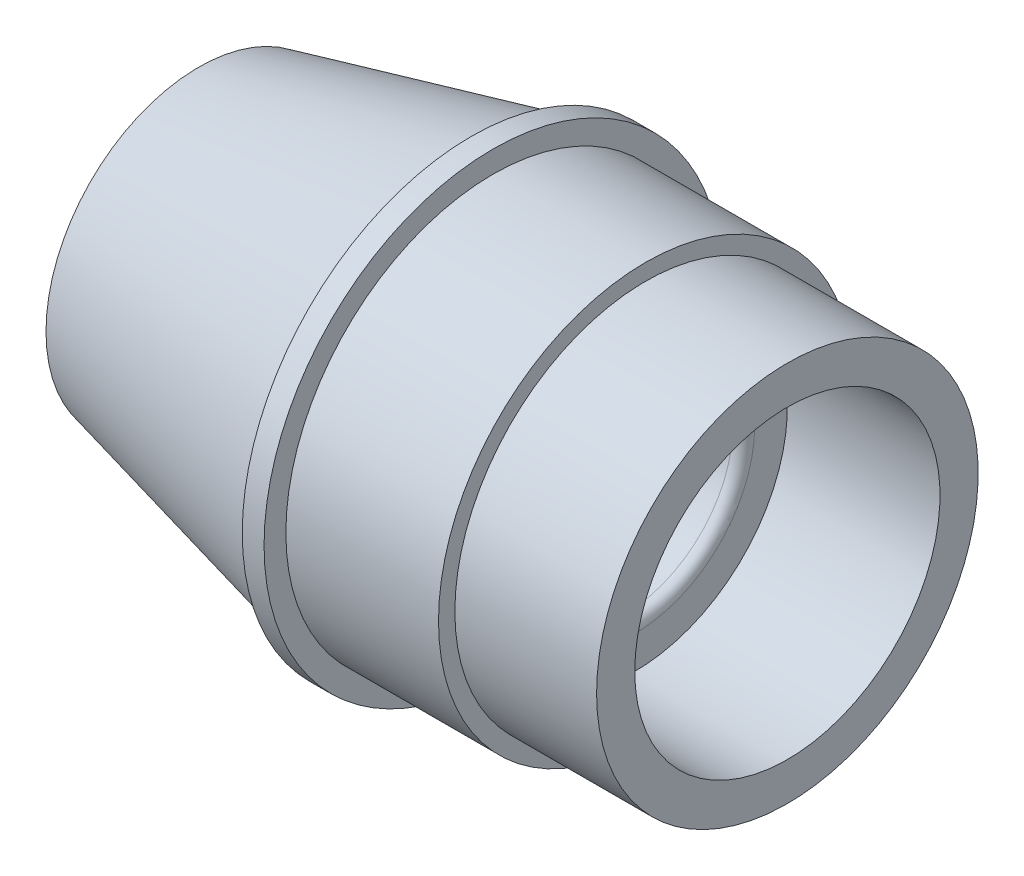
ISO-10303-21;
HEADER;
FILE_DESCRIPTION(('STEP AP214'),'2;1');
FILE_NAME('part.step','',(''),(''),'','','');
FILE_SCHEMA(('AUTOMOTIVE_DESIGN { 1 0 10303 214 1 1 1 1 }'));
ENDSEC;
DATA;
#1=APPLICATION_CONTEXT('core data for automotive mechanical design processes');
#2=APPLICATION_PROTOCOL_DEFINITION('international standard','automotive_design',2000,#1);
#3=PRODUCT_CONTEXT('',#1,'mechanical');
#4=PRODUCT('Part','Part','',(#3));
#5=PRODUCT_RELATED_PRODUCT_CATEGORY('part','',(#4));
#6=PRODUCT_DEFINITION_FORMATION('','',#4);
#7=PRODUCT_DEFINITION_CONTEXT('part definition',#1,'design');
#8=PRODUCT_DEFINITION('design','',#6,#7);
#9=PRODUCT_DEFINITION_SHAPE('','',#8);
#10=(LENGTH_UNIT() NAMED_UNIT(*) SI_UNIT(.MILLI.,.METRE.));
#11=(NAMED_UNIT(*) PLANE_ANGLE_UNIT() SI_UNIT($,.RADIAN.));
#12=(NAMED_UNIT(*) SI_UNIT($,.STERADIAN.) SOLID_ANGLE_UNIT());
#13=UNCERTAINTY_MEASURE_WITH_UNIT(LENGTH_MEASURE(1.E-05),#10,'distance_accuracy_value','');
#14=(GEOMETRIC_REPRESENTATION_CONTEXT(3) GLOBAL_UNCERTAINTY_ASSIGNED_CONTEXT((#13)) GLOBAL_UNIT_ASSIGNED_CONTEXT((#10,
#11,#12)) REPRESENTATION_CONTEXT('',''));
#15=CARTESIAN_POINT('',(0.,0.,0.));
#16=DIRECTION('',(0.,0.,1.));
#17=DIRECTION('',(1.,0.,0.));
#18=AXIS2_PLACEMENT_3D('',#15,#16,#17);
#19=CARTESIAN_POINT('',(-27.,10.,0.));
#20=DIRECTION('',(1.,0.,0.));
#21=DIRECTION('',(0.,0.,-1.));
#22=AXIS2_PLACEMENT_3D('',#19,#20,#21);
#23=PLANE('',#22);
#24=CARTESIAN_POINT('',(-27.,0.,0.));
#25=DIRECTION('',(-1.,0.,0.));
#26=DIRECTION('',(0.,0.,1.));
#27=AXIS2_PLACEMENT_3D('',#24,#25,#26);
#28=CIRCLE('',#27,10.);
#29=CARTESIAN_POINT('',(-27.,0.,10.));
#30=VERTEX_POINT('',#29);
#31=EDGE_CURVE('E76',#30,#30,#28,.T.);
#32=ORIENTED_EDGE('',*,*,#31,.F.);
#33=EDGE_LOOP('',(#32));
#34=FACE_BOUND('',#33,.T.);
#35=CARTESIAN_POINT('',(-27.,0.,0.));
#36=DIRECTION('',(-1.,0.,0.));
#37=DIRECTION('',(0.,0.,1.));
#38=AXIS2_PLACEMENT_3D('',#35,#36,#37);
#39=CIRCLE('',#38,14.);
#40=CARTESIAN_POINT('',(-27.,0.,14.));
#41=VERTEX_POINT('',#40);
#42=EDGE_CURVE('E10',#41,#41,#39,.T.);
#43=ORIENTED_EDGE('',*,*,#42,.T.);
#44=EDGE_LOOP('',(#43));
#45=FACE_BOUND('',#44,.T.);
#46=ADVANCED_FACE('F30',(#34,#45),#23,.F.);
#47=CARTESIAN_POINT('',(-2.22281554755738,0.,0.));
#48=DIRECTION('',(1.,0.,0.));
#49=DIRECTION('',(0.,0.,-1.));
#50=AXIS2_PLACEMENT_3D('',#47,#48,#49);
#51=CONICAL_SURFACE('',#50,19.9465242685862,0.235544980720863);
#52=ORIENTED_EDGE('',*,*,#42,.F.);
#53=EDGE_LOOP('',(#52));
#54=FACE_BOUND('',#53,.T.);
#55=CARTESIAN_POINT('',(-2.22281554755738,0.,0.));
#56=DIRECTION('',(-1.,0.,0.));
#57=DIRECTION('',(0.,0.,1.));
#58=AXIS2_PLACEMENT_3D('',#55,#56,#57);
#59=CIRCLE('',#58,19.9465242685862);
#60=CARTESIAN_POINT('',(-2.22281554755738,0.,19.9465242685862));
#61=VERTEX_POINT('',#60);
#62=EDGE_CURVE('E36',#61,#61,#59,.T.);
#63=ORIENTED_EDGE('',*,*,#62,.T.);
#64=EDGE_LOOP('',(#63));
#65=FACE_BOUND('',#64,.T.);
#66=ADVANCED_FACE('F83',(#54,#65),#51,.T.);
#67=CARTESIAN_POINT('',(-2.29064399472575,0.,0.));
#68=DIRECTION('',(-1.,0.,0.));
#69=DIRECTION('',(0.,0.,1.));
#70=AXIS2_PLACEMENT_3D('',#67,#68,#69);
#71=TOROIDAL_SURFACE('',#70,20.2291427984544,0.290643994725751);
#72=ORIENTED_EDGE('',*,*,#62,.F.);
#73=EDGE_LOOP('',(#72));
#74=FACE_BOUND('',#73,.T.);
#75=CARTESIAN_POINT('',(-2.,0.,0.));
#76=DIRECTION('',(-1.,0.,0.));
#77=DIRECTION('',(0.,0.,1.));
#78=AXIS2_PLACEMENT_3D('',#75,#76,#77);
#79=CIRCLE('',#78,20.2291427984544);
#80=CARTESIAN_POINT('',(-2.,0.,20.2291427984544));
#81=VERTEX_POINT('',#80);
#82=EDGE_CURVE('E40',#81,#81,#79,.T.);
#83=ORIENTED_EDGE('',*,*,#82,.T.);
#84=EDGE_LOOP('',(#83));
#85=FACE_BOUND('',#84,.T.);
#86=ADVANCED_FACE('F87',(#74,#85),#71,.F.);
#87=CARTESIAN_POINT('',(-2.,20.2291427984544,0.));
#88=DIRECTION('',(1.,0.,0.));
#89=DIRECTION('',(0.,0.,-1.));
#90=AXIS2_PLACEMENT_3D('',#87,#88,#89);
#91=PLANE('',#90);
#92=ORIENTED_EDGE('',*,*,#82,.F.);
#93=EDGE_LOOP('',(#92));
#94=FACE_BOUND('',#93,.T.);
#95=CARTESIAN_POINT('',(-2.,0.,0.));
#96=DIRECTION('',(-1.,0.,0.));
#97=DIRECTION('',(0.,0.,1.));
#98=AXIS2_PLACEMENT_3D('',#95,#96,#97);
#99=CIRCLE('',#98,21.);
#100=CARTESIAN_POINT('',(-2.,0.,21.));
#101=VERTEX_POINT('',#100);
#102=EDGE_CURVE('E44',#101,#101,#99,.T.);
#103=ORIENTED_EDGE('',*,*,#102,.T.);
#104=EDGE_LOOP('',(#103));
#105=FACE_BOUND('',#104,.T.);
#106=ADVANCED_FACE('F92',(#94,#105),#91,.F.);
#107=CARTESIAN_POINT('',(-27.,0.,0.));
#108=DIRECTION('',(-1.,0.,0.));
#109=DIRECTION('',(0.,0.,1.));
#110=AXIS2_PLACEMENT_3D('',#107,#108,#109);
#111=CYLINDRICAL_SURFACE('',#110,21.);
#112=ORIENTED_EDGE('',*,*,#102,.F.);
#113=EDGE_LOOP('',(#112));
#114=FACE_BOUND('',#113,.T.);
#115=CARTESIAN_POINT('',(0.,0.,0.));
#116=DIRECTION('',(-1.,0.,0.));
#117=DIRECTION('',(0.,0.,1.));
#118=AXIS2_PLACEMENT_3D('',#115,#116,#117);
#119=CIRCLE('',#118,21.);
#120=CARTESIAN_POINT('',(0.,0.,21.));
#121=VERTEX_POINT('',#120);
#122=EDGE_CURVE('E49',#121,#121,#119,.T.);
#123=ORIENTED_EDGE('',*,*,#122,.T.);
#124=EDGE_LOOP('',(#123));
#125=FACE_BOUND('',#124,.T.);
#126=ADVANCED_FACE('F98',(#114,#125),#111,.T.);
#127=CARTESIAN_POINT('',(0.,21.,0.));
#128=DIRECTION('',(-1.,0.,0.));
#129=DIRECTION('',(0.,0.,1.));
#130=AXIS2_PLACEMENT_3D('',#127,#128,#129);
#131=PLANE('',#130);
#132=ORIENTED_EDGE('',*,*,#122,.F.);
#133=EDGE_LOOP('',(#132));
#134=FACE_BOUND('',#133,.T.);
#135=CARTESIAN_POINT('',(0.,0.,0.));
#136=DIRECTION('',(-1.,0.,0.));
#137=DIRECTION('',(0.,0.,1.));
#138=AXIS2_PLACEMENT_3D('',#135,#136,#137);
#139=CIRCLE('',#138,19.);
#140=CARTESIAN_POINT('',(0.,0.,19.));
#141=VERTEX_POINT('',#140);
#142=EDGE_CURVE('E52',#141,#141,#139,.T.);
#143=ORIENTED_EDGE('',*,*,#142,.T.);
#144=EDGE_LOOP('',(#143));
#145=FACE_BOUND('',#144,.T.);
#146=ADVANCED_FACE('F102',(#134,#145),#131,.F.);
#147=CARTESIAN_POINT('',(-27.,0.,0.));
#148=DIRECTION('',(-1.,0.,0.));
#149=DIRECTION('',(0.,0.,1.));
#150=AXIS2_PLACEMENT_3D('',#147,#148,#149);
#151=CYLINDRICAL_SURFACE('',#150,19.);
#152=ORIENTED_EDGE('',*,*,#142,.F.);
#153=EDGE_LOOP('',(#152));
#154=FACE_BOUND('',#153,.T.);
#155=CARTESIAN_POINT('',(14.,0.,0.));
#156=DIRECTION('',(-1.,0.,0.));
#157=DIRECTION('',(0.,0.,1.));
#158=AXIS2_PLACEMENT_3D('',#155,#156,#157);
#159=CIRCLE('',#158,19.);
#160=CARTESIAN_POINT('',(14.,0.,19.));
#161=VERTEX_POINT('',#160);
#162=EDGE_CURVE('E55',#161,#161,#159,.T.);
#163=ORIENTED_EDGE('',*,*,#162,.T.);
#164=EDGE_LOOP('',(#163));
#165=FACE_BOUND('',#164,.T.);
#166=ADVANCED_FACE('F106',(#154,#165),#151,.T.);
#167=CARTESIAN_POINT('',(14.,19.,0.));
#168=DIRECTION('',(-1.,0.,0.));
#169=DIRECTION('',(0.,0.,1.));
#170=AXIS2_PLACEMENT_3D('',#167,#168,#169);
#171=PLANE('',#170);
#172=ORIENTED_EDGE('',*,*,#162,.F.);
#173=EDGE_LOOP('',(#172));
#174=FACE_BOUND('',#173,.T.);
#175=CARTESIAN_POINT('',(14.,0.,0.));
#176=DIRECTION('',(-1.,0.,0.));
#177=DIRECTION('',(0.,0.,1.));
#178=AXIS2_PLACEMENT_3D('',#175,#176,#177);
#179=CIRCLE('',#178,17.5);
#180=CARTESIAN_POINT('',(14.,0.,17.5));
#181=VERTEX_POINT('',#180);
#182=EDGE_CURVE('E58',#181,#181,#179,.T.);
#183=ORIENTED_EDGE('',*,*,#182,.T.);
#184=EDGE_LOOP('',(#183));
#185=FACE_BOUND('',#184,.T.);
#186=ADVANCED_FACE('F110',(#174,#185),#171,.F.);
#187=CARTESIAN_POINT('',(-27.,0.,0.));
#188=DIRECTION('',(-1.,0.,0.));
#189=DIRECTION('',(0.,0.,1.));
#190=AXIS2_PLACEMENT_3D('',#187,#188,#189);
#191=CYLINDRICAL_SURFACE('',#190,17.5);
#192=ORIENTED_EDGE('',*,*,#182,.F.);
#193=EDGE_LOOP('',(#192));
#194=FACE_BOUND('',#193,.T.);
#195=CARTESIAN_POINT('',(27.,0.,0.));
#196=DIRECTION('',(-1.,0.,0.));
#197=DIRECTION('',(0.,0.,1.));
#198=AXIS2_PLACEMENT_3D('',#195,#196,#197);
#199=CIRCLE('',#198,17.5);
#200=CARTESIAN_POINT('',(27.,0.,17.5));
#201=VERTEX_POINT('',#200);
#202=EDGE_CURVE('E61',#201,#201,#199,.T.);
#203=ORIENTED_EDGE('',*,*,#202,.T.);
#204=EDGE_LOOP('',(#203));
#205=FACE_BOUND('',#204,.T.);
#206=ADVANCED_FACE('F114',(#194,#205),#191,.T.);
#207=CARTESIAN_POINT('',(27.,17.5,0.));
#208=DIRECTION('',(-1.,0.,0.));
#209=DIRECTION('',(0.,0.,1.));
#210=AXIS2_PLACEMENT_3D('',#207,#208,#209);
#211=PLANE('',#210);
#212=ORIENTED_EDGE('',*,*,#202,.F.);
#213=EDGE_LOOP('',(#212));
#214=FACE_BOUND('',#213,.T.);
#215=CARTESIAN_POINT('',(27.,0.,0.));
#216=DIRECTION('',(-1.,0.,0.));
#217=DIRECTION('',(0.,0.,1.));
#218=AXIS2_PLACEMENT_3D('',#215,#216,#217);
#219=CIRCLE('',#218,14.);
#220=CARTESIAN_POINT('',(27.,0.,14.));
#221=VERTEX_POINT('',#220);
#222=EDGE_CURVE('E64',#221,#221,#219,.T.);
#223=ORIENTED_EDGE('',*,*,#222,.T.);
#224=EDGE_LOOP('',(#223));
#225=FACE_BOUND('',#224,.T.);
#226=ADVANCED_FACE('F118',(#214,#225),#211,.F.);
#227=CARTESIAN_POINT('',(-27.,0.,0.));
#228=DIRECTION('',(-1.,0.,0.));
#229=DIRECTION('',(0.,0.,1.));
#230=AXIS2_PLACEMENT_3D('',#227,#228,#229);
#231=CYLINDRICAL_SURFACE('',#230,14.);
#232=ORIENTED_EDGE('',*,*,#222,.F.);
#233=EDGE_LOOP('',(#232));
#234=FACE_BOUND('',#233,.T.);
#235=CARTESIAN_POINT('',(13.,0.,0.));
#236=DIRECTION('',(-1.,0.,0.));
#237=DIRECTION('',(0.,0.,1.));
#238=AXIS2_PLACEMENT_3D('',#235,#236,#237);
#239=CIRCLE('',#238,14.);
#240=CARTESIAN_POINT('',(13.,0.,14.));
#241=VERTEX_POINT('',#240);
#242=EDGE_CURVE('E67',#241,#241,#239,.T.);
#243=ORIENTED_EDGE('',*,*,#242,.T.);
#244=EDGE_LOOP('',(#243));
#245=FACE_BOUND('',#244,.T.);
#246=ADVANCED_FACE('F122',(#234,#245),#231,.F.);
#247=CARTESIAN_POINT('',(13.,14.,0.));
#248=DIRECTION('',(-1.,0.,0.));
#249=DIRECTION('',(0.,0.,1.));
#250=AXIS2_PLACEMENT_3D('',#247,#248,#249);
#251=PLANE('',#250);
#252=ORIENTED_EDGE('',*,*,#242,.F.);
#253=EDGE_LOOP('',(#252));
#254=FACE_BOUND('',#253,.T.);
#255=CARTESIAN_POINT('',(13.,0.,0.));
#256=DIRECTION('',(-1.,0.,0.));
#257=DIRECTION('',(0.,0.,1.));
#258=AXIS2_PLACEMENT_3D('',#255,#256,#257);
#259=CIRCLE('',#258,11.);
#260=CARTESIAN_POINT('',(13.,0.,11.));
#261=VERTEX_POINT('',#260);
#262=EDGE_CURVE('E70',#261,#261,#259,.T.);
#263=ORIENTED_EDGE('',*,*,#262,.T.);
#264=EDGE_LOOP('',(#263));
#265=FACE_BOUND('',#264,.T.);
#266=ADVANCED_FACE('F126',(#254,#265),#251,.F.);
#267=CARTESIAN_POINT('',(12.,0.,0.));
#268=DIRECTION('',(-1.,0.,0.));
#269=DIRECTION('',(0.,0.,1.));
#270=AXIS2_PLACEMENT_3D('',#267,#268,#269);
#271=TOROIDAL_SURFACE('',#270,11.,0.999999999999999);
#272=ORIENTED_EDGE('',*,*,#262,.F.);
#273=EDGE_LOOP('',(#272));
#274=FACE_BOUND('',#273,.T.);
#275=CARTESIAN_POINT('',(12.,0.,0.));
#276=DIRECTION('',(-1.,0.,0.));
#277=DIRECTION('',(0.,0.,1.));
#278=AXIS2_PLACEMENT_3D('',#275,#276,#277);
#279=CIRCLE('',#278,10.);
#280=CARTESIAN_POINT('',(12.,0.,10.));
#281=VERTEX_POINT('',#280);
#282=EDGE_CURVE('E73',#281,#281,#279,.T.);
#283=ORIENTED_EDGE('',*,*,#282,.T.);
#284=EDGE_LOOP('',(#283));
#285=FACE_BOUND('',#284,.T.);
#286=ADVANCED_FACE('F130',(#274,#285),#271,.T.);
#287=CARTESIAN_POINT('',(-27.,0.,0.));
#288=DIRECTION('',(-1.,0.,0.));
#289=DIRECTION('',(0.,0.,1.));
#290=AXIS2_PLACEMENT_3D('',#287,#288,#289);
#291=CYLINDRICAL_SURFACE('',#290,10.);
#292=ORIENTED_EDGE('',*,*,#282,.F.);
#293=EDGE_LOOP('',(#292));
#294=FACE_BOUND('',#293,.T.);
#295=ORIENTED_EDGE('',*,*,#31,.T.);
#296=EDGE_LOOP('',(#295));
#297=FACE_BOUND('',#296,.T.);
#298=ADVANCED_FACE('F80',(#294,#297),#291,.F.);
#299=CLOSED_SHELL('',(#46,#66,#86,#106,#126,#146,#166,#186,#206,#226,#246,#266,#286,#298));
#300=MANIFOLD_SOLID_BREP('B2',#299);
#301=ADVANCED_BREP_SHAPE_REPRESENTATION('',(#18,#300),#14);
#302=SHAPE_DEFINITION_REPRESENTATION(#9,#301);
ENDSEC;
END-ISO-10303-21;
